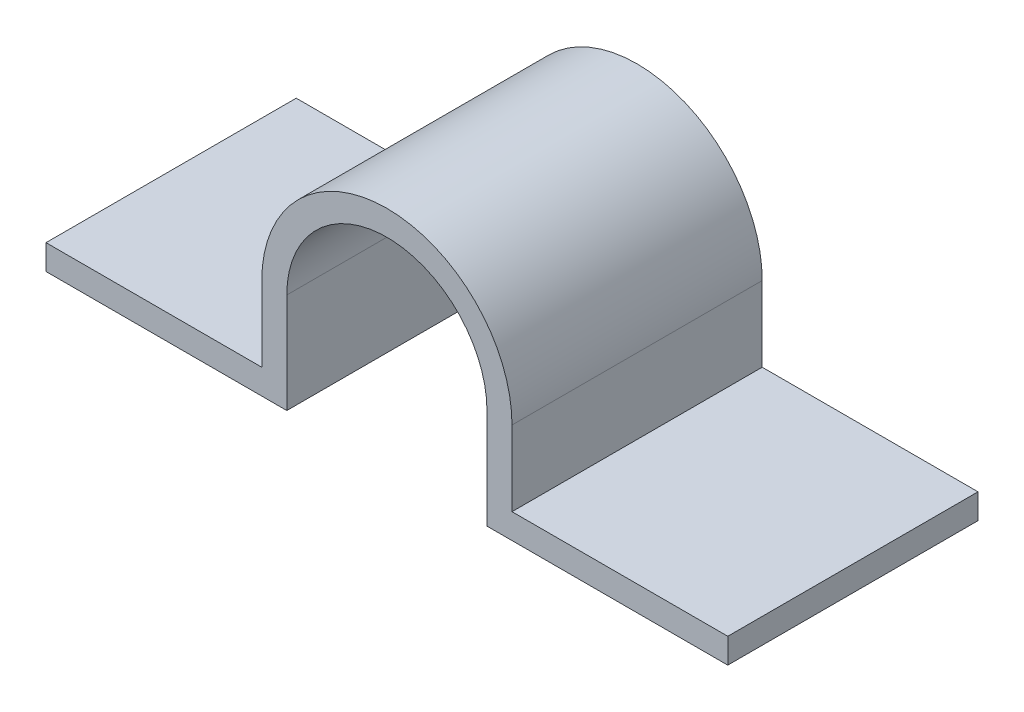
ISO-10303-21;
HEADER;
FILE_DESCRIPTION(('STEP AP214'),'2;1');
FILE_NAME('part.step','',(''),(''),'','','');
FILE_SCHEMA(('AUTOMOTIVE_DESIGN { 1 0 10303 214 1 1 1 1 }'));
ENDSEC;
DATA;
#1=APPLICATION_CONTEXT('core data for automotive mechanical design processes');
#2=APPLICATION_PROTOCOL_DEFINITION('international standard','automotive_design',2000,#1);
#3=PRODUCT_CONTEXT('',#1,'mechanical');
#4=PRODUCT('Part','Part','',(#3));
#5=PRODUCT_RELATED_PRODUCT_CATEGORY('part','',(#4));
#6=PRODUCT_DEFINITION_FORMATION('','',#4);
#7=PRODUCT_DEFINITION_CONTEXT('part definition',#1,'design');
#8=PRODUCT_DEFINITION('design','',#6,#7);
#9=PRODUCT_DEFINITION_SHAPE('','',#8);
#10=(LENGTH_UNIT() NAMED_UNIT(*) SI_UNIT(.MILLI.,.METRE.));
#11=(NAMED_UNIT(*) PLANE_ANGLE_UNIT() SI_UNIT($,.RADIAN.));
#12=(NAMED_UNIT(*) SI_UNIT($,.STERADIAN.) SOLID_ANGLE_UNIT());
#13=UNCERTAINTY_MEASURE_WITH_UNIT(LENGTH_MEASURE(1.E-05),#10,'distance_accuracy_value','');
#14=(GEOMETRIC_REPRESENTATION_CONTEXT(3) GLOBAL_UNCERTAINTY_ASSIGNED_CONTEXT((#13)) GLOBAL_UNIT_ASSIGNED_CONTEXT((#10,
#11,#12)) REPRESENTATION_CONTEXT('',''));
#15=CARTESIAN_POINT('',(0.,0.,0.));
#16=DIRECTION('',(0.,0.,1.));
#17=DIRECTION('',(1.,0.,0.));
#18=AXIS2_PLACEMENT_3D('',#15,#16,#17);
#19=CARTESIAN_POINT('',(4.,4.,10.));
#20=DIRECTION('',(1.,0.,0.));
#21=DIRECTION('',(0.,0.,-1.));
#22=AXIS2_PLACEMENT_3D('',#19,#20,#21);
#23=PLANE('',#22);
#24=DIRECTION('',(0.,-1.,0.));
#25=VECTOR('',#24,1.);
#26=CARTESIAN_POINT('',(4.,4.,0.));
#27=LINE('',#26,#25);
#28=CARTESIAN_POINT('',(4.,4.,0.));
#29=VERTEX_POINT('',#28);
#30=CARTESIAN_POINT('',(4.,0.,0.));
#31=VERTEX_POINT('',#30);
#32=EDGE_CURVE('E152',#29,#31,#27,.T.);
#33=ORIENTED_EDGE('',*,*,#32,.T.);
#34=DIRECTION('',(0.,0.,-1.));
#35=VECTOR('',#34,1.);
#36=CARTESIAN_POINT('',(4.,0.,10.));
#37=LINE('',#36,#35);
#38=CARTESIAN_POINT('',(4.,0.,10.));
#39=VERTEX_POINT('',#38);
#40=EDGE_CURVE('E11',#39,#31,#37,.T.);
#41=ORIENTED_EDGE('',*,*,#40,.F.);
#42=DIRECTION('',(0.,-1.,0.));
#43=VECTOR('',#42,1.);
#44=CARTESIAN_POINT('',(4.,4.,10.));
#45=LINE('',#44,#43);
#46=CARTESIAN_POINT('',(4.,4.,10.));
#47=VERTEX_POINT('',#46);
#48=EDGE_CURVE('E98',#47,#39,#45,.T.);
#49=ORIENTED_EDGE('',*,*,#48,.F.);
#50=DIRECTION('',(0.,0.,-1.));
#51=VECTOR('',#50,1.);
#52=CARTESIAN_POINT('',(4.,4.,10.));
#53=LINE('',#52,#51);
#54=EDGE_CURVE('E49',#47,#29,#53,.T.);
#55=ORIENTED_EDGE('',*,*,#54,.T.);
#56=EDGE_LOOP('',(#33,#41,#49,#55));
#57=FACE_BOUND('',#56,.T.);
#58=ADVANCED_FACE('F33',(#57),#23,.F.);
#59=CARTESIAN_POINT('',(13.6233223759705,0.,10.));
#60=DIRECTION('',(0.,-1.,0.));
#61=DIRECTION('',(1.,0.,0.));
#62=AXIS2_PLACEMENT_3D('',#59,#60,#61);
#63=PLANE('',#62);
#64=DIRECTION('',(-1.,0.,0.));
#65=VECTOR('',#64,1.);
#66=CARTESIAN_POINT('',(13.6233223759705,0.,0.));
#67=LINE('',#66,#65);
#68=CARTESIAN_POINT('',(13.6233223759705,0.,0.));
#69=VERTEX_POINT('',#68);
#70=EDGE_CURVE('E154',#69,#31,#67,.T.);
#71=ORIENTED_EDGE('',*,*,#70,.F.);
#72=DIRECTION('',(0.,0.,-1.));
#73=VECTOR('',#72,1.);
#74=CARTESIAN_POINT('',(13.6233223759705,0.,10.));
#75=LINE('',#74,#73);
#76=CARTESIAN_POINT('',(13.6233223759705,0.,10.));
#77=VERTEX_POINT('',#76);
#78=EDGE_CURVE('E41',#77,#69,#75,.T.);
#79=ORIENTED_EDGE('',*,*,#78,.F.);
#80=DIRECTION('',(-1.,0.,0.));
#81=VECTOR('',#80,1.);
#82=CARTESIAN_POINT('',(13.6233223759705,0.,10.));
#83=LINE('',#82,#81);
#84=EDGE_CURVE('E219',#77,#39,#83,.T.);
#85=ORIENTED_EDGE('',*,*,#84,.T.);
#86=ORIENTED_EDGE('',*,*,#40,.T.);
#87=EDGE_LOOP('',(#71,#79,#85,#86));
#88=FACE_BOUND('',#87,.T.);
#89=ADVANCED_FACE('F206',(#88),#63,.T.);
#90=CARTESIAN_POINT('',(13.6233223759705,1.,10.));
#91=DIRECTION('',(1.,0.,0.));
#92=DIRECTION('',(0.,0.,-1.));
#93=AXIS2_PLACEMENT_3D('',#90,#91,#92);
#94=PLANE('',#93);
#95=DIRECTION('',(0.,-1.,0.));
#96=VECTOR('',#95,1.);
#97=CARTESIAN_POINT('',(13.6233223759705,1.,0.));
#98=LINE('',#97,#96);
#99=CARTESIAN_POINT('',(13.6233223759705,1.,0.));
#100=VERTEX_POINT('',#99);
#101=EDGE_CURVE('E157',#100,#69,#98,.T.);
#102=ORIENTED_EDGE('',*,*,#101,.F.);
#103=DIRECTION('',(0.,0.,-1.));
#104=VECTOR('',#103,1.);
#105=CARTESIAN_POINT('',(13.6233223759705,1.,10.));
#106=LINE('',#105,#104);
#107=CARTESIAN_POINT('',(13.6233223759705,1.,10.));
#108=VERTEX_POINT('',#107);
#109=EDGE_CURVE('E196',#108,#100,#106,.T.);
#110=ORIENTED_EDGE('',*,*,#109,.F.);
#111=DIRECTION('',(0.,-1.,0.));
#112=VECTOR('',#111,1.);
#113=CARTESIAN_POINT('',(13.6233223759705,1.,10.));
#114=LINE('',#113,#112);
#115=EDGE_CURVE('E203',#108,#77,#114,.T.);
#116=ORIENTED_EDGE('',*,*,#115,.T.);
#117=ORIENTED_EDGE('',*,*,#78,.T.);
#118=EDGE_LOOP('',(#102,#110,#116,#117));
#119=FACE_BOUND('',#118,.T.);
#120=ADVANCED_FACE('F201',(#119),#94,.T.);
#121=CARTESIAN_POINT('',(5.,1.,10.));
#122=DIRECTION('',(0.,1.,0.));
#123=DIRECTION('',(0.,0.,1.));
#124=AXIS2_PLACEMENT_3D('',#121,#122,#123);
#125=PLANE('',#124);
#126=DIRECTION('',(1.,0.,0.));
#127=VECTOR('',#126,1.);
#128=CARTESIAN_POINT('',(5.,1.,0.));
#129=LINE('',#128,#127);
#130=CARTESIAN_POINT('',(5.,1.,0.));
#131=VERTEX_POINT('',#130);
#132=EDGE_CURVE('E160',#131,#100,#129,.T.);
#133=ORIENTED_EDGE('',*,*,#132,.F.);
#134=DIRECTION('',(0.,0.,-1.));
#135=VECTOR('',#134,1.);
#136=CARTESIAN_POINT('',(5.,1.,10.));
#137=LINE('',#136,#135);
#138=CARTESIAN_POINT('',(5.,1.,10.));
#139=VERTEX_POINT('',#138);
#140=EDGE_CURVE('E194',#139,#131,#137,.T.);
#141=ORIENTED_EDGE('',*,*,#140,.F.);
#142=DIRECTION('',(1.,0.,0.));
#143=VECTOR('',#142,1.);
#144=CARTESIAN_POINT('',(5.,1.,10.));
#145=LINE('',#144,#143);
#146=EDGE_CURVE('E216',#139,#108,#145,.T.);
#147=ORIENTED_EDGE('',*,*,#146,.T.);
#148=ORIENTED_EDGE('',*,*,#109,.T.);
#149=EDGE_LOOP('',(#133,#141,#147,#148));
#150=FACE_BOUND('',#149,.T.);
#151=ADVANCED_FACE('F213',(#150),#125,.T.);
#152=CARTESIAN_POINT('',(5.,4.,10.));
#153=DIRECTION('',(1.,0.,0.));
#154=DIRECTION('',(0.,1.,0.));
#155=AXIS2_PLACEMENT_3D('',#152,#153,#154);
#156=PLANE('',#155);
#157=DIRECTION('',(0.,-1.,0.));
#158=VECTOR('',#157,1.);
#159=CARTESIAN_POINT('',(5.,4.,0.));
#160=LINE('',#159,#158);
#161=CARTESIAN_POINT('',(5.,4.,0.));
#162=VERTEX_POINT('',#161);
#163=EDGE_CURVE('E163',#162,#131,#160,.T.);
#164=ORIENTED_EDGE('',*,*,#163,.F.);
#165=DIRECTION('',(0.,0.,-1.));
#166=VECTOR('',#165,1.);
#167=CARTESIAN_POINT('',(5.,4.,10.));
#168=LINE('',#167,#166);
#169=CARTESIAN_POINT('',(5.,4.,10.));
#170=VERTEX_POINT('',#169);
#171=EDGE_CURVE('E192',#170,#162,#168,.T.);
#172=ORIENTED_EDGE('',*,*,#171,.F.);
#173=DIRECTION('',(0.,-1.,0.));
#174=VECTOR('',#173,1.);
#175=CARTESIAN_POINT('',(5.,4.,10.));
#176=LINE('',#175,#174);
#177=EDGE_CURVE('E221',#170,#139,#176,.T.);
#178=ORIENTED_EDGE('',*,*,#177,.T.);
#179=ORIENTED_EDGE('',*,*,#140,.T.);
#180=EDGE_LOOP('',(#164,#172,#178,#179));
#181=FACE_BOUND('',#180,.T.);
#182=ADVANCED_FACE('F263',(#181),#156,.T.);
#183=CARTESIAN_POINT('',(0.,4.,10.));
#184=DIRECTION('',(0.,0.,-1.));
#185=DIRECTION('',(-1.,0.,0.));
#186=AXIS2_PLACEMENT_3D('',#183,#184,#185);
#187=CYLINDRICAL_SURFACE('',#186,5.);
#188=CARTESIAN_POINT('',(0.,4.,0.));
#189=DIRECTION('',(0.,0.,1.));
#190=DIRECTION('',(1.,0.,0.));
#191=AXIS2_PLACEMENT_3D('',#188,#189,#190);
#192=CIRCLE('',#191,5.);
#193=CARTESIAN_POINT('',(-5.,4.,0.));
#194=VERTEX_POINT('',#193);
#195=EDGE_CURVE('E166',#162,#194,#192,.T.);
#196=ORIENTED_EDGE('',*,*,#195,.T.);
#197=DIRECTION('',(0.,0.,-1.));
#198=VECTOR('',#197,1.);
#199=CARTESIAN_POINT('',(-5.,4.,10.));
#200=LINE('',#199,#198);
#201=CARTESIAN_POINT('',(-5.,4.,10.));
#202=VERTEX_POINT('',#201);
#203=EDGE_CURVE('E189',#202,#194,#200,.T.);
#204=ORIENTED_EDGE('',*,*,#203,.F.);
#205=CARTESIAN_POINT('',(0.,4.,10.));
#206=DIRECTION('',(0.,0.,1.));
#207=DIRECTION('',(1.,0.,0.));
#208=AXIS2_PLACEMENT_3D('',#205,#206,#207);
#209=CIRCLE('',#208,5.);
#210=EDGE_CURVE('E227',#170,#202,#209,.T.);
#211=ORIENTED_EDGE('',*,*,#210,.F.);
#212=ORIENTED_EDGE('',*,*,#171,.T.);
#213=EDGE_LOOP('',(#196,#204,#211,#212));
#214=FACE_BOUND('',#213,.T.);
#215=ADVANCED_FACE('F266',(#214),#187,.T.);
#216=CARTESIAN_POINT('',(-5.,4.,10.));
#217=DIRECTION('',(1.,0.,0.));
#218=DIRECTION('',(0.,1.,0.));
#219=AXIS2_PLACEMENT_3D('',#216,#217,#218);
#220=PLANE('',#219);
#221=DIRECTION('',(0.,-1.,0.));
#222=VECTOR('',#221,1.);
#223=CARTESIAN_POINT('',(-5.,4.,0.));
#224=LINE('',#223,#222);
#225=CARTESIAN_POINT('',(-5.,1.,0.));
#226=VERTEX_POINT('',#225);
#227=EDGE_CURVE('E168',#194,#226,#224,.T.);
#228=ORIENTED_EDGE('',*,*,#227,.T.);
#229=DIRECTION('',(0.,0.,-1.));
#230=VECTOR('',#229,1.);
#231=CARTESIAN_POINT('',(-5.,1.,10.));
#232=LINE('',#231,#230);
#233=CARTESIAN_POINT('',(-5.,1.,10.));
#234=VERTEX_POINT('',#233);
#235=EDGE_CURVE('E186',#234,#226,#232,.T.);
#236=ORIENTED_EDGE('',*,*,#235,.F.);
#237=DIRECTION('',(0.,-1.,0.));
#238=VECTOR('',#237,1.);
#239=CARTESIAN_POINT('',(-5.,4.,10.));
#240=LINE('',#239,#238);
#241=EDGE_CURVE('E229',#202,#234,#240,.T.);
#242=ORIENTED_EDGE('',*,*,#241,.F.);
#243=ORIENTED_EDGE('',*,*,#203,.T.);
#244=EDGE_LOOP('',(#228,#236,#242,#243));
#245=FACE_BOUND('',#244,.T.);
#246=ADVANCED_FACE('F270',(#245),#220,.F.);
#247=CARTESIAN_POINT('',(-5.,1.,10.));
#248=DIRECTION('',(0.,-1.,0.));
#249=DIRECTION('',(0.,0.,-1.));
#250=AXIS2_PLACEMENT_3D('',#247,#248,#249);
#251=PLANE('',#250);
#252=DIRECTION('',(-1.,0.,0.));
#253=VECTOR('',#252,1.);
#254=CARTESIAN_POINT('',(-5.,1.,0.));
#255=LINE('',#254,#253);
#256=CARTESIAN_POINT('',(-13.6233223759705,1.,0.));
#257=VERTEX_POINT('',#256);
#258=EDGE_CURVE('E170',#226,#257,#255,.T.);
#259=ORIENTED_EDGE('',*,*,#258,.T.);
#260=DIRECTION('',(0.,0.,-1.));
#261=VECTOR('',#260,1.);
#262=CARTESIAN_POINT('',(-13.6233223759705,1.,10.));
#263=LINE('',#262,#261);
#264=CARTESIAN_POINT('',(-13.6233223759705,1.,10.));
#265=VERTEX_POINT('',#264);
#266=EDGE_CURVE('E183',#265,#257,#263,.T.);
#267=ORIENTED_EDGE('',*,*,#266,.F.);
#268=DIRECTION('',(-1.,0.,0.));
#269=VECTOR('',#268,1.);
#270=CARTESIAN_POINT('',(-5.,1.,10.));
#271=LINE('',#270,#269);
#272=EDGE_CURVE('E231',#234,#265,#271,.T.);
#273=ORIENTED_EDGE('',*,*,#272,.F.);
#274=ORIENTED_EDGE('',*,*,#235,.T.);
#275=EDGE_LOOP('',(#259,#267,#273,#274));
#276=FACE_BOUND('',#275,.T.);
#277=ADVANCED_FACE('F237',(#276),#251,.F.);
#278=CARTESIAN_POINT('',(-13.6233223759705,1.,10.));
#279=DIRECTION('',(1.,0.,0.));
#280=DIRECTION('',(0.,0.,-1.));
#281=AXIS2_PLACEMENT_3D('',#278,#279,#280);
#282=PLANE('',#281);
#283=DIRECTION('',(0.,-1.,0.));
#284=VECTOR('',#283,1.);
#285=CARTESIAN_POINT('',(-13.6233223759705,1.,0.));
#286=LINE('',#285,#284);
#287=CARTESIAN_POINT('',(-13.6233223759705,0.,0.));
#288=VERTEX_POINT('',#287);
#289=EDGE_CURVE('E172',#257,#288,#286,.T.);
#290=ORIENTED_EDGE('',*,*,#289,.T.);
#291=DIRECTION('',(0.,0.,-1.));
#292=VECTOR('',#291,1.);
#293=CARTESIAN_POINT('',(-13.6233223759705,0.,10.));
#294=LINE('',#293,#292);
#295=CARTESIAN_POINT('',(-13.6233223759705,0.,10.));
#296=VERTEX_POINT('',#295);
#297=EDGE_CURVE('E144',#296,#288,#294,.T.);
#298=ORIENTED_EDGE('',*,*,#297,.F.);
#299=DIRECTION('',(0.,-1.,0.));
#300=VECTOR('',#299,1.);
#301=CARTESIAN_POINT('',(-13.6233223759705,1.,10.));
#302=LINE('',#301,#300);
#303=EDGE_CURVE('E132',#265,#296,#302,.T.);
#304=ORIENTED_EDGE('',*,*,#303,.F.);
#305=ORIENTED_EDGE('',*,*,#266,.T.);
#306=EDGE_LOOP('',(#290,#298,#304,#305));
#307=FACE_BOUND('',#306,.T.);
#308=ADVANCED_FACE('F241',(#307),#282,.F.);
#309=CARTESIAN_POINT('',(-13.6233223759705,0.,10.));
#310=DIRECTION('',(0.,1.,0.));
#311=DIRECTION('',(-1.,0.,0.));
#312=AXIS2_PLACEMENT_3D('',#309,#310,#311);
#313=PLANE('',#312);
#314=DIRECTION('',(1.,0.,0.));
#315=VECTOR('',#314,1.);
#316=CARTESIAN_POINT('',(-13.6233223759705,0.,0.));
#317=LINE('',#316,#315);
#318=CARTESIAN_POINT('',(-4.,0.,0.));
#319=VERTEX_POINT('',#318);
#320=EDGE_CURVE('E141',#288,#319,#317,.T.);
#321=ORIENTED_EDGE('',*,*,#320,.T.);
#322=DIRECTION('',(0.,0.,-1.));
#323=VECTOR('',#322,1.);
#324=CARTESIAN_POINT('',(-4.,0.,10.));
#325=LINE('',#324,#323);
#326=CARTESIAN_POINT('',(-4.,0.,10.));
#327=VERTEX_POINT('',#326);
#328=EDGE_CURVE('E138',#327,#319,#325,.T.);
#329=ORIENTED_EDGE('',*,*,#328,.F.);
#330=DIRECTION('',(1.,0.,0.));
#331=VECTOR('',#330,1.);
#332=CARTESIAN_POINT('',(-13.6233223759705,0.,10.));
#333=LINE('',#332,#331);
#334=EDGE_CURVE('E126',#296,#327,#333,.T.);
#335=ORIENTED_EDGE('',*,*,#334,.F.);
#336=ORIENTED_EDGE('',*,*,#297,.T.);
#337=EDGE_LOOP('',(#321,#329,#335,#336));
#338=FACE_BOUND('',#337,.T.);
#339=ADVANCED_FACE('F139',(#338),#313,.F.);
#340=CARTESIAN_POINT('',(-4.,4.,10.));
#341=DIRECTION('',(1.,0.,0.));
#342=DIRECTION('',(0.,0.,-1.));
#343=AXIS2_PLACEMENT_3D('',#340,#341,#342);
#344=PLANE('',#343);
#345=DIRECTION('',(0.,-1.,0.));
#346=VECTOR('',#345,1.);
#347=CARTESIAN_POINT('',(-4.,4.,0.));
#348=LINE('',#347,#346);
#349=CARTESIAN_POINT('',(-4.,4.,0.));
#350=VERTEX_POINT('',#349);
#351=EDGE_CURVE('E175',#350,#319,#348,.T.);
#352=ORIENTED_EDGE('',*,*,#351,.F.);
#353=DIRECTION('',(0.,0.,-1.));
#354=VECTOR('',#353,1.);
#355=CARTESIAN_POINT('',(-4.,4.,10.));
#356=LINE('',#355,#354);
#357=CARTESIAN_POINT('',(-4.,4.,10.));
#358=VERTEX_POINT('',#357);
#359=EDGE_CURVE('E86',#358,#350,#356,.T.);
#360=ORIENTED_EDGE('',*,*,#359,.F.);
#361=DIRECTION('',(0.,-1.,0.));
#362=VECTOR('',#361,1.);
#363=CARTESIAN_POINT('',(-4.,4.,10.));
#364=LINE('',#363,#362);
#365=EDGE_CURVE('E130',#358,#327,#364,.T.);
#366=ORIENTED_EDGE('',*,*,#365,.T.);
#367=ORIENTED_EDGE('',*,*,#328,.T.);
#368=EDGE_LOOP('',(#352,#360,#366,#367));
#369=FACE_BOUND('',#368,.T.);
#370=ADVANCED_FACE('F146',(#369),#344,.T.);
#371=CARTESIAN_POINT('',(0.,4.,10.));
#372=DIRECTION('',(0.,0.,-1.));
#373=DIRECTION('',(-1.,0.,0.));
#374=AXIS2_PLACEMENT_3D('',#371,#372,#373);
#375=CYLINDRICAL_SURFACE('',#374,4.);
#376=CARTESIAN_POINT('',(0.,4.,0.));
#377=DIRECTION('',(0.,0.,1.));
#378=DIRECTION('',(1.,0.,0.));
#379=AXIS2_PLACEMENT_3D('',#376,#377,#378);
#380=CIRCLE('',#379,4.);
#381=EDGE_CURVE('E177',#29,#350,#380,.T.);
#382=ORIENTED_EDGE('',*,*,#381,.F.);
#383=ORIENTED_EDGE('',*,*,#54,.F.);
#384=CARTESIAN_POINT('',(0.,4.,10.));
#385=DIRECTION('',(0.,0.,1.));
#386=DIRECTION('',(1.,0.,0.));
#387=AXIS2_PLACEMENT_3D('',#384,#385,#386);
#388=CIRCLE('',#387,4.);
#389=EDGE_CURVE('E147',#47,#358,#388,.T.);
#390=ORIENTED_EDGE('',*,*,#389,.T.);
#391=ORIENTED_EDGE('',*,*,#359,.T.);
#392=EDGE_LOOP('',(#382,#383,#390,#391));
#393=FACE_BOUND('',#392,.T.);
#394=ADVANCED_FACE('F242',(#393),#375,.F.);
#395=CARTESIAN_POINT('',(0.,4.,10.));
#396=DIRECTION('',(0.,0.,1.));
#397=DIRECTION('',(1.,0.,0.));
#398=AXIS2_PLACEMENT_3D('',#395,#396,#397);
#399=PLANE('',#398);
#400=ORIENTED_EDGE('',*,*,#48,.T.);
#401=ORIENTED_EDGE('',*,*,#84,.F.);
#402=ORIENTED_EDGE('',*,*,#115,.F.);
#403=ORIENTED_EDGE('',*,*,#146,.F.);
#404=ORIENTED_EDGE('',*,*,#177,.F.);
#405=ORIENTED_EDGE('',*,*,#210,.T.);
#406=ORIENTED_EDGE('',*,*,#241,.T.);
#407=ORIENTED_EDGE('',*,*,#272,.T.);
#408=ORIENTED_EDGE('',*,*,#303,.T.);
#409=ORIENTED_EDGE('',*,*,#334,.T.);
#410=ORIENTED_EDGE('',*,*,#365,.F.);
#411=ORIENTED_EDGE('',*,*,#389,.F.);
#412=EDGE_LOOP('',(#400,#401,#402,#403,#404,#405,#406,#407,#408,#409,#410,#411));
#413=FACE_BOUND('',#412,.T.);
#414=ADVANCED_FACE('F128',(#413),#399,.T.);
#415=CARTESIAN_POINT('',(0.,4.,0.));
#416=DIRECTION('',(0.,0.,1.));
#417=DIRECTION('',(1.,0.,0.));
#418=AXIS2_PLACEMENT_3D('',#415,#416,#417);
#419=PLANE('',#418);
#420=ORIENTED_EDGE('',*,*,#32,.F.);
#421=ORIENTED_EDGE('',*,*,#381,.T.);
#422=ORIENTED_EDGE('',*,*,#351,.T.);
#423=ORIENTED_EDGE('',*,*,#320,.F.);
#424=ORIENTED_EDGE('',*,*,#289,.F.);
#425=ORIENTED_EDGE('',*,*,#258,.F.);
#426=ORIENTED_EDGE('',*,*,#227,.F.);
#427=ORIENTED_EDGE('',*,*,#195,.F.);
#428=ORIENTED_EDGE('',*,*,#163,.T.);
#429=ORIENTED_EDGE('',*,*,#132,.T.);
#430=ORIENTED_EDGE('',*,*,#101,.T.);
#431=ORIENTED_EDGE('',*,*,#70,.T.);
#432=EDGE_LOOP('',(#420,#421,#422,#423,#424,#425,#426,#427,#428,#429,#430,#431));
#433=FACE_BOUND('',#432,.T.);
#434=ADVANCED_FACE('F208',(#433),#419,.F.);
#435=CLOSED_SHELL('',(#58,#89,#120,#151,#182,#215,#246,#277,#308,#339,#370,#394,#414,#434));
#436=MANIFOLD_SOLID_BREP('B2',#435);
#437=ADVANCED_BREP_SHAPE_REPRESENTATION('',(#18,#436),#14);
#438=SHAPE_DEFINITION_REPRESENTATION(#9,#437);
ENDSEC;
END-ISO-10303-21;
